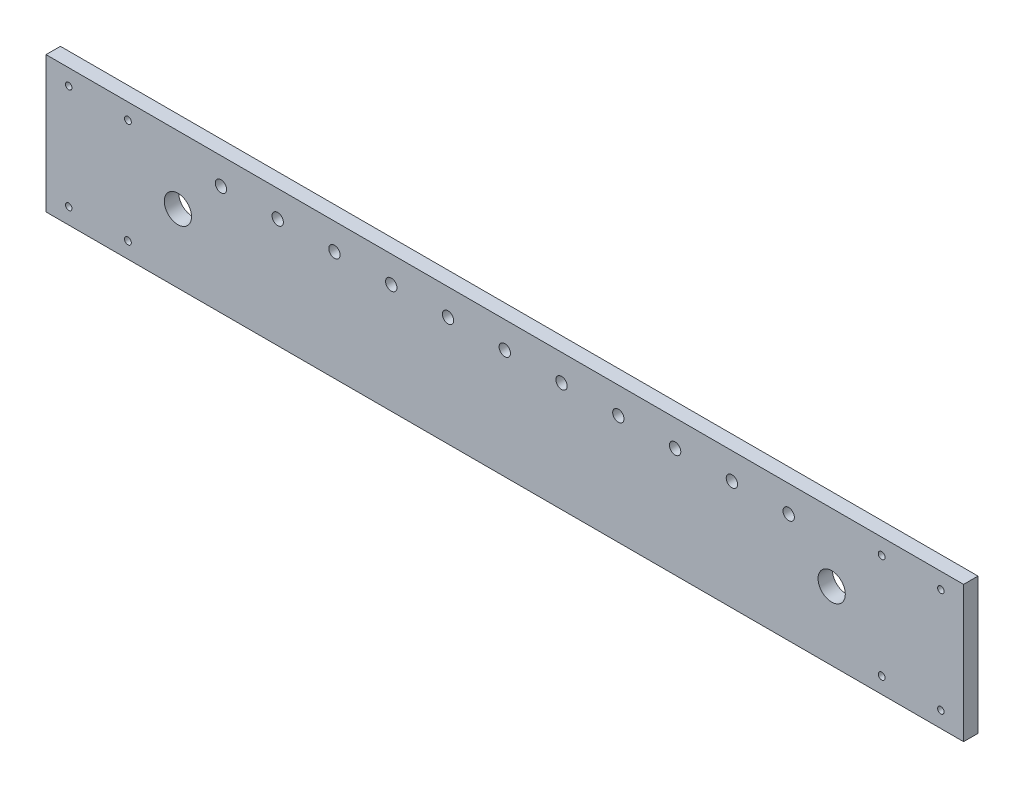
ISO-10303-21;
HEADER;
FILE_DESCRIPTION(('STEP AP214'),'2;1');
FILE_NAME('part.step','',(''),(''),'','','');
FILE_SCHEMA(('AUTOMOTIVE_DESIGN { 1 0 10303 214 1 1 1 1 }'));
ENDSEC;
DATA;
#1=APPLICATION_CONTEXT('core data for automotive mechanical design processes');
#2=APPLICATION_PROTOCOL_DEFINITION('international standard','automotive_design',2000,#1);
#3=PRODUCT_CONTEXT('',#1,'mechanical');
#4=PRODUCT('Part','Part','',(#3));
#5=PRODUCT_RELATED_PRODUCT_CATEGORY('part','',(#4));
#6=PRODUCT_DEFINITION_FORMATION('','',#4);
#7=PRODUCT_DEFINITION_CONTEXT('part definition',#1,'design');
#8=PRODUCT_DEFINITION('design','',#6,#7);
#9=PRODUCT_DEFINITION_SHAPE('','',#8);
#10=(LENGTH_UNIT() NAMED_UNIT(*) SI_UNIT(.MILLI.,.METRE.));
#11=(NAMED_UNIT(*) PLANE_ANGLE_UNIT() SI_UNIT($,.RADIAN.));
#12=(NAMED_UNIT(*) SI_UNIT($,.STERADIAN.) SOLID_ANGLE_UNIT());
#13=UNCERTAINTY_MEASURE_WITH_UNIT(LENGTH_MEASURE(1.E-05),#10,'distance_accuracy_value','');
#14=(GEOMETRIC_REPRESENTATION_CONTEXT(3) GLOBAL_UNCERTAINTY_ASSIGNED_CONTEXT((#13)) GLOBAL_UNIT_ASSIGNED_CONTEXT((#10,
#11,#12)) REPRESENTATION_CONTEXT('',''));
#15=CARTESIAN_POINT('',(0.,0.,0.));
#16=DIRECTION('',(0.,0.,1.));
#17=DIRECTION('',(1.,0.,0.));
#18=AXIS2_PLACEMENT_3D('',#15,#16,#17);
#19=CARTESIAN_POINT('',(0.,30.,-6.35));
#20=DIRECTION('',(0.,1.,0.));
#21=DIRECTION('',(-1.,0.,0.));
#22=AXIS2_PLACEMENT_3D('',#19,#20,#21);
#23=PLANE('',#22);
#24=DIRECTION('',(-1.,0.,0.));
#25=VECTOR('',#24,1.);
#26=CARTESIAN_POINT('',(0.,30.,0.));
#27=LINE('',#26,#25);
#28=CARTESIAN_POINT('',(199.519643121393,30.,0.));
#29=VERTEX_POINT('',#28);
#30=CARTESIAN_POINT('',(-204.530552078607,30.,0.));
#31=VERTEX_POINT('',#30);
#32=EDGE_CURVE('E102',#29,#31,#27,.T.);
#33=ORIENTED_EDGE('',*,*,#32,.F.);
#34=DIRECTION('',(0.,0.,1.));
#35=VECTOR('',#34,1.);
#36=CARTESIAN_POINT('',(199.519643121393,30.,-6.35));
#37=LINE('',#36,#35);
#38=CARTESIAN_POINT('',(199.519643121393,30.,-6.35));
#39=VERTEX_POINT('',#38);
#40=EDGE_CURVE('E11',#39,#29,#37,.T.);
#41=ORIENTED_EDGE('',*,*,#40,.F.);
#42=DIRECTION('',(-1.,0.,0.));
#43=VECTOR('',#42,1.);
#44=CARTESIAN_POINT('',(0.,30.,-6.35));
#45=LINE('',#44,#43);
#46=CARTESIAN_POINT('',(-204.530552078607,30.,-6.35));
#47=VERTEX_POINT('',#46);
#48=EDGE_CURVE('E95',#39,#47,#45,.T.);
#49=ORIENTED_EDGE('',*,*,#48,.T.);
#50=DIRECTION('',(0.,0.,1.));
#51=VECTOR('',#50,1.);
#52=CARTESIAN_POINT('',(-204.530552078607,30.,-6.35));
#53=LINE('',#52,#51);
#54=EDGE_CURVE('E78',#47,#31,#53,.T.);
#55=ORIENTED_EDGE('',*,*,#54,.T.);
#56=EDGE_LOOP('',(#33,#41,#49,#55));
#57=FACE_BOUND('',#56,.T.);
#58=ADVANCED_FACE('F35',(#57),#23,.T.);
#59=CARTESIAN_POINT('',(199.519643121393,0.,-6.35));
#60=DIRECTION('',(1.,0.,0.));
#61=DIRECTION('',(0.,0.,-1.));
#62=AXIS2_PLACEMENT_3D('',#59,#60,#61);
#63=PLANE('',#62);
#64=DIRECTION('',(0.,1.,0.));
#65=VECTOR('',#64,1.);
#66=CARTESIAN_POINT('',(199.519643121393,0.,0.));
#67=LINE('',#66,#65);
#68=CARTESIAN_POINT('',(199.519643121393,-30.,0.));
#69=VERTEX_POINT('',#68);
#70=EDGE_CURVE('E97',#69,#29,#67,.T.);
#71=ORIENTED_EDGE('',*,*,#70,.F.);
#72=DIRECTION('',(0.,0.,1.));
#73=VECTOR('',#72,1.);
#74=CARTESIAN_POINT('',(199.519643121393,-30.,-6.35));
#75=LINE('',#74,#73);
#76=CARTESIAN_POINT('',(199.519643121393,-30.,-6.35));
#77=VERTEX_POINT('',#76);
#78=EDGE_CURVE('E44',#77,#69,#75,.T.);
#79=ORIENTED_EDGE('',*,*,#78,.F.);
#80=DIRECTION('',(0.,1.,0.));
#81=VECTOR('',#80,1.);
#82=CARTESIAN_POINT('',(199.519643121393,0.,-6.35));
#83=LINE('',#82,#81);
#84=EDGE_CURVE('E92',#77,#39,#83,.T.);
#85=ORIENTED_EDGE('',*,*,#84,.T.);
#86=ORIENTED_EDGE('',*,*,#40,.T.);
#87=EDGE_LOOP('',(#71,#79,#85,#86));
#88=FACE_BOUND('',#87,.T.);
#89=ADVANCED_FACE('F246',(#88),#63,.T.);
#90=CARTESIAN_POINT('',(0.,-30.,-6.35));
#91=DIRECTION('',(0.,-1.,0.));
#92=DIRECTION('',(1.,0.,0.));
#93=AXIS2_PLACEMENT_3D('',#90,#91,#92);
#94=PLANE('',#93);
#95=DIRECTION('',(1.,0.,0.));
#96=VECTOR('',#95,1.);
#97=CARTESIAN_POINT('',(0.,-30.,0.));
#98=LINE('',#97,#96);
#99=CARTESIAN_POINT('',(-204.530552078607,-30.,0.));
#100=VERTEX_POINT('',#99);
#101=EDGE_CURVE('E86',#100,#69,#98,.T.);
#102=ORIENTED_EDGE('',*,*,#101,.F.);
#103=DIRECTION('',(0.,0.,1.));
#104=VECTOR('',#103,1.);
#105=CARTESIAN_POINT('',(-204.530552078607,-30.,-6.35));
#106=LINE('',#105,#104);
#107=CARTESIAN_POINT('',(-204.530552078607,-30.,-6.35));
#108=VERTEX_POINT('',#107);
#109=EDGE_CURVE('E81',#108,#100,#106,.T.);
#110=ORIENTED_EDGE('',*,*,#109,.F.);
#111=DIRECTION('',(1.,0.,0.));
#112=VECTOR('',#111,1.);
#113=CARTESIAN_POINT('',(0.,-30.,-6.35));
#114=LINE('',#113,#112);
#115=EDGE_CURVE('E84',#108,#77,#114,.T.);
#116=ORIENTED_EDGE('',*,*,#115,.T.);
#117=ORIENTED_EDGE('',*,*,#78,.T.);
#118=EDGE_LOOP('',(#102,#110,#116,#117));
#119=FACE_BOUND('',#118,.T.);
#120=ADVANCED_FACE('F83',(#119),#94,.T.);
#121=CARTESIAN_POINT('',(-204.530552078607,0.,-6.35));
#122=DIRECTION('',(-1.,0.,0.));
#123=DIRECTION('',(0.,0.,1.));
#124=AXIS2_PLACEMENT_3D('',#121,#122,#123);
#125=PLANE('',#124);
#126=DIRECTION('',(0.,-1.,0.));
#127=VECTOR('',#126,1.);
#128=CARTESIAN_POINT('',(-204.530552078607,0.,0.));
#129=LINE('',#128,#127);
#130=EDGE_CURVE('E105',#31,#100,#129,.T.);
#131=ORIENTED_EDGE('',*,*,#130,.F.);
#132=ORIENTED_EDGE('',*,*,#54,.F.);
#133=DIRECTION('',(0.,-1.,0.));
#134=VECTOR('',#133,1.);
#135=CARTESIAN_POINT('',(-204.530552078607,0.,-6.35));
#136=LINE('',#135,#134);
#137=EDGE_CURVE('E91',#47,#108,#136,.T.);
#138=ORIENTED_EDGE('',*,*,#137,.T.);
#139=ORIENTED_EDGE('',*,*,#109,.T.);
#140=EDGE_LOOP('',(#131,#132,#138,#139));
#141=FACE_BOUND('',#140,.T.);
#142=ADVANCED_FACE('F94',(#141),#125,.T.);
#143=CARTESIAN_POINT('',(0.,0.,-6.35));
#144=DIRECTION('',(0.,0.,1.));
#145=DIRECTION('',(1.,0.,0.));
#146=AXIS2_PLACEMENT_3D('',#143,#144,#145);
#147=PLANE('',#146);
#148=CARTESIAN_POINT('',(141.435795620172,0.190500000000144,-6.35));
#149=DIRECTION('',(0.,0.,-1.));
#150=DIRECTION('',(-1.,0.,0.));
#151=AXIS2_PLACEMENT_3D('',#148,#149,#150);
#152=CIRCLE('',#151,6.00000000000505);
#153=CARTESIAN_POINT('',(135.435795620167,0.190500000000144,-6.35));
#154=VERTEX_POINT('',#153);
#155=EDGE_CURVE('E128',#154,#154,#152,.T.);
#156=ORIENTED_EDGE('',*,*,#155,.F.);
#157=EDGE_LOOP('',(#156));
#158=FACE_BOUND('',#157,.T.);
#159=CARTESIAN_POINT('',(-146.446704577386,0.190500000000546,-6.35));
#160=DIRECTION('',(0.,0.,-1.));
#161=DIRECTION('',(1.,0.,0.));
#162=AXIS2_PLACEMENT_3D('',#159,#160,#161);
#163=CIRCLE('',#162,6.00000000000504);
#164=CARTESIAN_POINT('',(-140.446704577381,0.190500000000546,-6.35));
#165=VERTEX_POINT('',#164);
#166=EDGE_CURVE('E134',#165,#165,#163,.T.);
#167=ORIENTED_EDGE('',*,*,#166,.F.);
#168=EDGE_LOOP('',(#167));
#169=FACE_BOUND('',#168,.T.);
#170=CARTESIAN_POINT('',(189.519643121393,22.9999999999999,-6.35));
#171=DIRECTION('',(0.,0.,1.));
#172=DIRECTION('',(-1.,0.,0.));
#173=AXIS2_PLACEMENT_3D('',#170,#171,#172);
#174=CIRCLE('',#173,1.42499999999996);
#175=CARTESIAN_POINT('',(188.094643121393,22.9999999999999,-6.35));
#176=VERTEX_POINT('',#175);
#177=EDGE_CURVE('E154',#176,#176,#174,.T.);
#178=ORIENTED_EDGE('',*,*,#177,.T.);
#179=EDGE_LOOP('',(#178));
#180=FACE_BOUND('',#179,.T.);
#181=CARTESIAN_POINT('',(189.519643121393,-22.9999999999999,-6.35));
#182=DIRECTION('',(0.,0.,1.));
#183=DIRECTION('',(1.,0.,0.));
#184=AXIS2_PLACEMENT_3D('',#181,#182,#183);
#185=CIRCLE('',#184,1.42500000000002);
#186=CARTESIAN_POINT('',(190.944643121393,-22.9999999999999,-6.35));
#187=VERTEX_POINT('',#186);
#188=EDGE_CURVE('E148',#187,#187,#185,.T.);
#189=ORIENTED_EDGE('',*,*,#188,.T.);
#190=EDGE_LOOP('',(#189));
#191=FACE_BOUND('',#190,.T.);
#192=CARTESIAN_POINT('',(-194.530552078607,-23.,-6.35));
#193=DIRECTION('',(0.,0.,1.));
#194=DIRECTION('',(-1.,0.,0.));
#195=AXIS2_PLACEMENT_3D('',#192,#193,#194);
#196=CIRCLE('',#195,1.42500000000002);
#197=CARTESIAN_POINT('',(-195.955552078607,-23.,-6.35));
#198=VERTEX_POINT('',#197);
#199=EDGE_CURVE('E141',#198,#198,#196,.T.);
#200=ORIENTED_EDGE('',*,*,#199,.T.);
#201=EDGE_LOOP('',(#200));
#202=FACE_BOUND('',#201,.T.);
#203=CARTESIAN_POINT('',(-194.530552078607,23.,-6.35));
#204=DIRECTION('',(0.,0.,1.));
#205=DIRECTION('',(1.,0.,0.));
#206=AXIS2_PLACEMENT_3D('',#203,#204,#205);
#207=CIRCLE('',#206,1.42500000000002);
#208=CARTESIAN_POINT('',(-193.105552078607,23.,-6.35));
#209=VERTEX_POINT('',#208);
#210=EDGE_CURVE('E159',#209,#209,#207,.T.);
#211=ORIENTED_EDGE('',*,*,#210,.T.);
#212=EDGE_LOOP('',(#211));
#213=FACE_BOUND('',#212,.T.);
#214=CARTESIAN_POINT('',(163.444948118961,22.9999999999999,-6.35));
#215=DIRECTION('',(0.,0.,-1.));
#216=DIRECTION('',(-1.,0.,0.));
#217=AXIS2_PLACEMENT_3D('',#214,#215,#216);
#218=CIRCLE('',#217,1.50000000000014);
#219=CARTESIAN_POINT('',(161.944948118961,22.9999999999999,-6.35));
#220=VERTEX_POINT('',#219);
#221=EDGE_CURVE('E162',#220,#220,#218,.T.);
#222=ORIENTED_EDGE('',*,*,#221,.F.);
#223=EDGE_LOOP('',(#222));
#224=FACE_BOUND('',#223,.T.);
#225=CARTESIAN_POINT('',(163.444948118961,-23.,-6.35));
#226=DIRECTION('',(0.,0.,-1.));
#227=DIRECTION('',(-1.,0.,0.));
#228=AXIS2_PLACEMENT_3D('',#225,#226,#227);
#229=CIRCLE('',#228,1.5);
#230=CARTESIAN_POINT('',(161.944948118961,-23.,-6.35));
#231=VERTEX_POINT('',#230);
#232=EDGE_CURVE('E168',#231,#231,#229,.T.);
#233=ORIENTED_EDGE('',*,*,#232,.F.);
#234=EDGE_LOOP('',(#233));
#235=FACE_BOUND('',#234,.T.);
#236=CARTESIAN_POINT('',(-168.455857076175,-23.,-6.35));
#237=DIRECTION('',(0.,0.,-1.));
#238=DIRECTION('',(-1.,0.,0.));
#239=AXIS2_PLACEMENT_3D('',#236,#237,#238);
#240=CIRCLE('',#239,1.5);
#241=CARTESIAN_POINT('',(-169.955857076175,-23.,-6.35));
#242=VERTEX_POINT('',#241);
#243=EDGE_CURVE('E165',#242,#242,#240,.T.);
#244=ORIENTED_EDGE('',*,*,#243,.F.);
#245=EDGE_LOOP('',(#244));
#246=FACE_BOUND('',#245,.T.);
#247=CARTESIAN_POINT('',(-168.455857076175,22.9999999999999,-6.35));
#248=DIRECTION('',(0.,0.,-1.));
#249=DIRECTION('',(-1.,0.,0.));
#250=AXIS2_PLACEMENT_3D('',#247,#248,#249);
#251=CIRCLE('',#250,1.50000000000014);
#252=CARTESIAN_POINT('',(-169.955857076175,22.9999999999999,-6.35));
#253=VERTEX_POINT('',#252);
#254=EDGE_CURVE('E117',#253,#253,#251,.T.);
#255=ORIENTED_EDGE('',*,*,#254,.F.);
#256=EDGE_LOOP('',(#255));
#257=FACE_BOUND('',#256,.T.);
#258=CARTESIAN_POINT('',(-127.505454478587,18.3224130468526,-6.35));
#259=DIRECTION('',(0.,0.,1.));
#260=DIRECTION('',(1.,0.,0.));
#261=AXIS2_PLACEMENT_3D('',#258,#259,#260);
#262=CIRCLE('',#261,2.5);
#263=CARTESIAN_POINT('',(-125.005454478587,18.3224130468526,-6.35));
#264=VERTEX_POINT('',#263);
#265=EDGE_CURVE('E125',#264,#264,#262,.T.);
#266=ORIENTED_EDGE('',*,*,#265,.T.);
#267=EDGE_LOOP('',(#266));
#268=FACE_BOUND('',#267,.T.);
#269=CARTESIAN_POINT('',(-102.505454478587,18.3224130468523,-6.35));
#270=DIRECTION('',(0.,0.,1.));
#271=DIRECTION('',(1.,0.,0.));
#272=AXIS2_PLACEMENT_3D('',#269,#270,#271);
#273=CIRCLE('',#272,2.5);
#274=CARTESIAN_POINT('',(-100.005454478587,18.3224130468523,-6.35));
#275=VERTEX_POINT('',#274);
#276=EDGE_CURVE('E227',#275,#275,#273,.T.);
#277=ORIENTED_EDGE('',*,*,#276,.T.);
#278=EDGE_LOOP('',(#277));
#279=FACE_BOUND('',#278,.T.);
#280=CARTESIAN_POINT('',(47.4945455214126,18.3224130468507,-6.35));
#281=DIRECTION('',(0.,0.,1.));
#282=DIRECTION('',(1.,0.,0.));
#283=AXIS2_PLACEMENT_3D('',#280,#281,#282);
#284=CIRCLE('',#283,2.5);
#285=CARTESIAN_POINT('',(49.9945455214126,18.3224130468507,-6.35));
#286=VERTEX_POINT('',#285);
#287=EDGE_CURVE('E178',#286,#286,#284,.T.);
#288=ORIENTED_EDGE('',*,*,#287,.T.);
#289=EDGE_LOOP('',(#288));
#290=FACE_BOUND('',#289,.T.);
#291=CARTESIAN_POINT('',(72.4945455214125,18.3224130468505,-6.35));
#292=DIRECTION('',(0.,0.,1.));
#293=DIRECTION('',(1.,0.,0.));
#294=AXIS2_PLACEMENT_3D('',#291,#292,#293);
#295=CIRCLE('',#294,2.5);
#296=CARTESIAN_POINT('',(74.9945455214125,18.3224130468505,-6.35));
#297=VERTEX_POINT('',#296);
#298=EDGE_CURVE('E205',#297,#297,#295,.T.);
#299=ORIENTED_EDGE('',*,*,#298,.T.);
#300=EDGE_LOOP('',(#299));
#301=FACE_BOUND('',#300,.T.);
#302=CARTESIAN_POINT('',(122.494545521413,18.3224130468499,-6.35));
#303=DIRECTION('',(0.,0.,1.));
#304=DIRECTION('',(1.,0.,0.));
#305=AXIS2_PLACEMENT_3D('',#302,#303,#304);
#306=CIRCLE('',#305,2.5);
#307=CARTESIAN_POINT('',(124.994545521413,18.3224130468499,-6.35));
#308=VERTEX_POINT('',#307);
#309=EDGE_CURVE('E204',#308,#308,#306,.T.);
#310=ORIENTED_EDGE('',*,*,#309,.T.);
#311=EDGE_LOOP('',(#310));
#312=FACE_BOUND('',#311,.T.);
#313=CARTESIAN_POINT('',(-77.5054544785875,18.322413046852,-6.35));
#314=DIRECTION('',(0.,0.,1.));
#315=DIRECTION('',(1.,0.,0.));
#316=AXIS2_PLACEMENT_3D('',#313,#314,#315);
#317=CIRCLE('',#316,2.5);
#318=CARTESIAN_POINT('',(-75.0054544785875,18.322413046852,-6.35));
#319=VERTEX_POINT('',#318);
#320=EDGE_CURVE('E217',#319,#319,#317,.T.);
#321=ORIENTED_EDGE('',*,*,#320,.T.);
#322=EDGE_LOOP('',(#321));
#323=FACE_BOUND('',#322,.T.);
#324=CARTESIAN_POINT('',(22.4945455214125,18.3224130468511,-6.35));
#325=DIRECTION('',(0.,0.,1.));
#326=DIRECTION('',(1.,0.,0.));
#327=AXIS2_PLACEMENT_3D('',#324,#325,#326);
#328=CIRCLE('',#327,2.5);
#329=CARTESIAN_POINT('',(24.9945455214125,18.3224130468511,-6.35));
#330=VERTEX_POINT('',#329);
#331=EDGE_CURVE('E179',#330,#330,#328,.T.);
#332=ORIENTED_EDGE('',*,*,#331,.T.);
#333=EDGE_LOOP('',(#332));
#334=FACE_BOUND('',#333,.T.);
#335=CARTESIAN_POINT('',(-2.50545447858738,18.3224130468513,-6.35));
#336=DIRECTION('',(0.,0.,1.));
#337=DIRECTION('',(1.,0.,0.));
#338=AXIS2_PLACEMENT_3D('',#335,#336,#337);
#339=CIRCLE('',#338,2.5);
#340=CARTESIAN_POINT('',(-0.00545447858737958,18.3224130468513,-6.35));
#341=VERTEX_POINT('',#340);
#342=EDGE_CURVE('E185',#341,#341,#339,.T.);
#343=ORIENTED_EDGE('',*,*,#342,.T.);
#344=EDGE_LOOP('',(#343));
#345=FACE_BOUND('',#344,.T.);
#346=CARTESIAN_POINT('',(-27.5054544785875,18.3224130468515,-6.35));
#347=DIRECTION('',(0.,0.,1.));
#348=DIRECTION('',(1.,0.,0.));
#349=AXIS2_PLACEMENT_3D('',#346,#347,#348);
#350=CIRCLE('',#349,2.5);
#351=CARTESIAN_POINT('',(-25.0054544785875,18.3224130468515,-6.35));
#352=VERTEX_POINT('',#351);
#353=EDGE_CURVE('E191',#352,#352,#350,.T.);
#354=ORIENTED_EDGE('',*,*,#353,.T.);
#355=EDGE_LOOP('',(#354));
#356=FACE_BOUND('',#355,.T.);
#357=CARTESIAN_POINT('',(-52.5054544785874,18.3224130468518,-6.35));
#358=DIRECTION('',(0.,0.,1.));
#359=DIRECTION('',(1.,0.,0.));
#360=AXIS2_PLACEMENT_3D('',#357,#358,#359);
#361=CIRCLE('',#360,2.5);
#362=CARTESIAN_POINT('',(-50.0054544785874,18.3224130468518,-6.35));
#363=VERTEX_POINT('',#362);
#364=EDGE_CURVE('E197',#363,#363,#361,.T.);
#365=ORIENTED_EDGE('',*,*,#364,.T.);
#366=EDGE_LOOP('',(#365));
#367=FACE_BOUND('',#366,.T.);
#368=CARTESIAN_POINT('',(97.4945455214125,18.3224130468503,-6.35));
#369=DIRECTION('',(0.,0.,1.));
#370=DIRECTION('',(1.,0.,0.));
#371=AXIS2_PLACEMENT_3D('',#368,#369,#370);
#372=CIRCLE('',#371,2.5);
#373=CARTESIAN_POINT('',(99.9945455214125,18.3224130468503,-6.35));
#374=VERTEX_POINT('',#373);
#375=EDGE_CURVE('E106',#374,#374,#372,.T.);
#376=ORIENTED_EDGE('',*,*,#375,.T.);
#377=EDGE_LOOP('',(#376));
#378=FACE_BOUND('',#377,.T.);
#379=ORIENTED_EDGE('',*,*,#48,.F.);
#380=ORIENTED_EDGE('',*,*,#84,.F.);
#381=ORIENTED_EDGE('',*,*,#115,.F.);
#382=ORIENTED_EDGE('',*,*,#137,.F.);
#383=EDGE_LOOP('',(#379,#380,#381,#382));
#384=FACE_BOUND('',#383,.T.);
#385=ADVANCED_FACE('F90',(#158,#169,#180,#191,#202,#213,#224,#235,#246,#257,#268,#279,#290,#301,
#312,#323,#334,#345,#356,#367,#378,#384),#147,.F.);
#386=CARTESIAN_POINT('',(0.,0.,0.));
#387=DIRECTION('',(0.,0.,1.));
#388=DIRECTION('',(1.,0.,0.));
#389=AXIS2_PLACEMENT_3D('',#386,#387,#388);
#390=PLANE('',#389);
#391=CARTESIAN_POINT('',(141.435795620172,0.190500000000144,0.));
#392=DIRECTION('',(0.,0.,1.));
#393=DIRECTION('',(1.,0.,0.));
#394=AXIS2_PLACEMENT_3D('',#391,#392,#393);
#395=CIRCLE('',#394,6.00000000000505);
#396=CARTESIAN_POINT('',(147.435795620177,0.190500000000144,0.));
#397=VERTEX_POINT('',#396);
#398=EDGE_CURVE('E38',#397,#397,#395,.T.);
#399=ORIENTED_EDGE('',*,*,#398,.F.);
#400=EDGE_LOOP('',(#399));
#401=FACE_BOUND('',#400,.T.);
#402=CARTESIAN_POINT('',(-146.446704577386,0.190500000000546,0.));
#403=DIRECTION('',(0.,0.,1.));
#404=DIRECTION('',(1.,0.,0.));
#405=AXIS2_PLACEMENT_3D('',#402,#403,#404);
#406=CIRCLE('',#405,6.00000000000504);
#407=CARTESIAN_POINT('',(-140.446704577381,0.190500000000546,0.));
#408=VERTEX_POINT('',#407);
#409=EDGE_CURVE('E126',#408,#408,#406,.T.);
#410=ORIENTED_EDGE('',*,*,#409,.F.);
#411=EDGE_LOOP('',(#410));
#412=FACE_BOUND('',#411,.T.);
#413=CARTESIAN_POINT('',(189.519643121393,22.9999999999999,0.));
#414=DIRECTION('',(0.,0.,1.));
#415=DIRECTION('',(-1.,0.,0.));
#416=AXIS2_PLACEMENT_3D('',#413,#414,#415);
#417=CIRCLE('',#416,1.42499999999996);
#418=CARTESIAN_POINT('',(188.094643121393,22.9999999999999,0.));
#419=VERTEX_POINT('',#418);
#420=EDGE_CURVE('E132',#419,#419,#417,.T.);
#421=ORIENTED_EDGE('',*,*,#420,.F.);
#422=EDGE_LOOP('',(#421));
#423=FACE_BOUND('',#422,.T.);
#424=CARTESIAN_POINT('',(189.519643121393,-22.9999999999999,0.));
#425=DIRECTION('',(0.,0.,1.));
#426=DIRECTION('',(1.,0.,0.));
#427=AXIS2_PLACEMENT_3D('',#424,#425,#426);
#428=CIRCLE('',#427,1.42500000000002);
#429=CARTESIAN_POINT('',(190.944643121393,-22.9999999999999,0.));
#430=VERTEX_POINT('',#429);
#431=EDGE_CURVE('E151',#430,#430,#428,.T.);
#432=ORIENTED_EDGE('',*,*,#431,.F.);
#433=EDGE_LOOP('',(#432));
#434=FACE_BOUND('',#433,.T.);
#435=CARTESIAN_POINT('',(-194.530552078607,-23.,0.));
#436=DIRECTION('',(0.,0.,1.));
#437=DIRECTION('',(-1.,0.,0.));
#438=AXIS2_PLACEMENT_3D('',#435,#436,#437);
#439=CIRCLE('',#438,1.42500000000002);
#440=CARTESIAN_POINT('',(-195.955552078607,-23.,0.));
#441=VERTEX_POINT('',#440);
#442=EDGE_CURVE('E145',#441,#441,#439,.T.);
#443=ORIENTED_EDGE('',*,*,#442,.F.);
#444=EDGE_LOOP('',(#443));
#445=FACE_BOUND('',#444,.T.);
#446=CARTESIAN_POINT('',(-194.530552078607,23.,0.));
#447=DIRECTION('',(0.,0.,1.));
#448=DIRECTION('',(1.,0.,0.));
#449=AXIS2_PLACEMENT_3D('',#446,#447,#448);
#450=CIRCLE('',#449,1.42500000000002);
#451=CARTESIAN_POINT('',(-193.105552078607,23.,0.));
#452=VERTEX_POINT('',#451);
#453=EDGE_CURVE('E144',#452,#452,#450,.T.);
#454=ORIENTED_EDGE('',*,*,#453,.F.);
#455=EDGE_LOOP('',(#454));
#456=FACE_BOUND('',#455,.T.);
#457=CARTESIAN_POINT('',(163.444948118961,22.9999999999999,0.));
#458=DIRECTION('',(0.,0.,1.));
#459=DIRECTION('',(1.,0.,0.));
#460=AXIS2_PLACEMENT_3D('',#457,#458,#459);
#461=CIRCLE('',#460,1.50000000000014);
#462=CARTESIAN_POINT('',(164.944948118961,22.9999999999999,0.));
#463=VERTEX_POINT('',#462);
#464=EDGE_CURVE('E123',#463,#463,#461,.T.);
#465=ORIENTED_EDGE('',*,*,#464,.F.);
#466=EDGE_LOOP('',(#465));
#467=FACE_BOUND('',#466,.T.);
#468=CARTESIAN_POINT('',(163.444948118961,-23.,0.));
#469=DIRECTION('',(0.,0.,1.));
#470=DIRECTION('',(1.,0.,0.));
#471=AXIS2_PLACEMENT_3D('',#468,#469,#470);
#472=CIRCLE('',#471,1.5);
#473=CARTESIAN_POINT('',(164.944948118961,-23.,0.));
#474=VERTEX_POINT('',#473);
#475=EDGE_CURVE('E120',#474,#474,#472,.T.);
#476=ORIENTED_EDGE('',*,*,#475,.F.);
#477=EDGE_LOOP('',(#476));
#478=FACE_BOUND('',#477,.T.);
#479=CARTESIAN_POINT('',(-168.455857076175,-23.,0.));
#480=DIRECTION('',(0.,0.,1.));
#481=DIRECTION('',(1.,0.,0.));
#482=AXIS2_PLACEMENT_3D('',#479,#480,#481);
#483=CIRCLE('',#482,1.5);
#484=CARTESIAN_POINT('',(-166.955857076175,-23.,0.));
#485=VERTEX_POINT('',#484);
#486=EDGE_CURVE('E116',#485,#485,#483,.T.);
#487=ORIENTED_EDGE('',*,*,#486,.F.);
#488=EDGE_LOOP('',(#487));
#489=FACE_BOUND('',#488,.T.);
#490=CARTESIAN_POINT('',(-168.455857076175,22.9999999999999,0.));
#491=DIRECTION('',(0.,0.,1.));
#492=DIRECTION('',(1.,0.,0.));
#493=AXIS2_PLACEMENT_3D('',#490,#491,#492);
#494=CIRCLE('',#493,1.50000000000014);
#495=CARTESIAN_POINT('',(-166.955857076175,22.9999999999999,0.));
#496=VERTEX_POINT('',#495);
#497=EDGE_CURVE('E113',#496,#496,#494,.T.);
#498=ORIENTED_EDGE('',*,*,#497,.F.);
#499=EDGE_LOOP('',(#498));
#500=FACE_BOUND('',#499,.T.);
#501=CARTESIAN_POINT('',(-127.505454478587,18.3224130468526,0.));
#502=DIRECTION('',(0.,0.,1.));
#503=DIRECTION('',(1.,0.,0.));
#504=AXIS2_PLACEMENT_3D('',#501,#502,#503);
#505=CIRCLE('',#504,2.5);
#506=CARTESIAN_POINT('',(-125.005454478587,18.3224130468526,0.));
#507=VERTEX_POINT('',#506);
#508=EDGE_CURVE('E230',#507,#507,#505,.T.);
#509=ORIENTED_EDGE('',*,*,#508,.F.);
#510=EDGE_LOOP('',(#509));
#511=FACE_BOUND('',#510,.T.);
#512=CARTESIAN_POINT('',(-102.505454478587,18.3224130468523,0.));
#513=DIRECTION('',(0.,0.,1.));
#514=DIRECTION('',(1.,0.,0.));
#515=AXIS2_PLACEMENT_3D('',#512,#513,#514);
#516=CIRCLE('',#515,2.5);
#517=CARTESIAN_POINT('',(-100.005454478587,18.3224130468523,0.));
#518=VERTEX_POINT('',#517);
#519=EDGE_CURVE('E200',#518,#518,#516,.T.);
#520=ORIENTED_EDGE('',*,*,#519,.F.);
#521=EDGE_LOOP('',(#520));
#522=FACE_BOUND('',#521,.T.);
#523=CARTESIAN_POINT('',(47.4945455214126,18.3224130468507,0.));
#524=DIRECTION('',(0.,0.,1.));
#525=DIRECTION('',(1.,0.,0.));
#526=AXIS2_PLACEMENT_3D('',#523,#524,#525);
#527=CIRCLE('',#526,2.5);
#528=CARTESIAN_POINT('',(49.9945455214126,18.3224130468507,0.));
#529=VERTEX_POINT('',#528);
#530=EDGE_CURVE('E208',#529,#529,#527,.T.);
#531=ORIENTED_EDGE('',*,*,#530,.F.);
#532=EDGE_LOOP('',(#531));
#533=FACE_BOUND('',#532,.T.);
#534=CARTESIAN_POINT('',(72.4945455214125,18.3224130468505,0.));
#535=DIRECTION('',(0.,0.,1.));
#536=DIRECTION('',(1.,0.,0.));
#537=AXIS2_PLACEMENT_3D('',#534,#535,#536);
#538=CIRCLE('',#537,2.5);
#539=CARTESIAN_POINT('',(74.9945455214125,18.3224130468505,0.));
#540=VERTEX_POINT('',#539);
#541=EDGE_CURVE('E201',#540,#540,#538,.T.);
#542=ORIENTED_EDGE('',*,*,#541,.F.);
#543=EDGE_LOOP('',(#542));
#544=FACE_BOUND('',#543,.T.);
#545=CARTESIAN_POINT('',(122.494545521413,18.3224130468499,0.));
#546=DIRECTION('',(0.,0.,1.));
#547=DIRECTION('',(1.,0.,0.));
#548=AXIS2_PLACEMENT_3D('',#545,#546,#547);
#549=CIRCLE('',#548,2.5);
#550=CARTESIAN_POINT('',(124.994545521413,18.3224130468499,0.));
#551=VERTEX_POINT('',#550);
#552=EDGE_CURVE('E220',#551,#551,#549,.T.);
#553=ORIENTED_EDGE('',*,*,#552,.F.);
#554=EDGE_LOOP('',(#553));
#555=FACE_BOUND('',#554,.T.);
#556=CARTESIAN_POINT('',(-77.5054544785875,18.322413046852,0.));
#557=DIRECTION('',(0.,0.,1.));
#558=DIRECTION('',(1.,0.,0.));
#559=AXIS2_PLACEMENT_3D('',#556,#557,#558);
#560=CIRCLE('',#559,2.5);
#561=CARTESIAN_POINT('',(-75.0054544785875,18.322413046852,0.));
#562=VERTEX_POINT('',#561);
#563=EDGE_CURVE('E213',#562,#562,#560,.T.);
#564=ORIENTED_EDGE('',*,*,#563,.F.);
#565=EDGE_LOOP('',(#564));
#566=FACE_BOUND('',#565,.T.);
#567=CARTESIAN_POINT('',(22.4945455214125,18.3224130468511,0.));
#568=DIRECTION('',(0.,0.,1.));
#569=DIRECTION('',(1.,0.,0.));
#570=AXIS2_PLACEMENT_3D('',#567,#568,#569);
#571=CIRCLE('',#570,2.5);
#572=CARTESIAN_POINT('',(24.9945455214125,18.3224130468511,0.));
#573=VERTEX_POINT('',#572);
#574=EDGE_CURVE('E175',#573,#573,#571,.T.);
#575=ORIENTED_EDGE('',*,*,#574,.F.);
#576=EDGE_LOOP('',(#575));
#577=FACE_BOUND('',#576,.T.);
#578=CARTESIAN_POINT('',(-2.50545447858738,18.3224130468513,0.));
#579=DIRECTION('',(0.,0.,1.));
#580=DIRECTION('',(1.,0.,0.));
#581=AXIS2_PLACEMENT_3D('',#578,#579,#580);
#582=CIRCLE('',#581,2.5);
#583=CARTESIAN_POINT('',(-0.00545447858737958,18.3224130468513,0.));
#584=VERTEX_POINT('',#583);
#585=EDGE_CURVE('E182',#584,#584,#582,.T.);
#586=ORIENTED_EDGE('',*,*,#585,.F.);
#587=EDGE_LOOP('',(#586));
#588=FACE_BOUND('',#587,.T.);
#589=CARTESIAN_POINT('',(-27.5054544785875,18.3224130468515,0.));
#590=DIRECTION('',(0.,0.,1.));
#591=DIRECTION('',(1.,0.,0.));
#592=AXIS2_PLACEMENT_3D('',#589,#590,#591);
#593=CIRCLE('',#592,2.5);
#594=CARTESIAN_POINT('',(-25.0054544785875,18.3224130468515,0.));
#595=VERTEX_POINT('',#594);
#596=EDGE_CURVE('E188',#595,#595,#593,.T.);
#597=ORIENTED_EDGE('',*,*,#596,.F.);
#598=EDGE_LOOP('',(#597));
#599=FACE_BOUND('',#598,.T.);
#600=CARTESIAN_POINT('',(-52.5054544785874,18.3224130468518,0.));
#601=DIRECTION('',(0.,0.,1.));
#602=DIRECTION('',(1.,0.,0.));
#603=AXIS2_PLACEMENT_3D('',#600,#601,#602);
#604=CIRCLE('',#603,2.5);
#605=CARTESIAN_POINT('',(-50.0054544785874,18.3224130468518,0.));
#606=VERTEX_POINT('',#605);
#607=EDGE_CURVE('E194',#606,#606,#604,.T.);
#608=ORIENTED_EDGE('',*,*,#607,.F.);
#609=EDGE_LOOP('',(#608));
#610=FACE_BOUND('',#609,.T.);
#611=CARTESIAN_POINT('',(97.4945455214125,18.3224130468503,0.));
#612=DIRECTION('',(0.,0.,1.));
#613=DIRECTION('',(1.,0.,0.));
#614=AXIS2_PLACEMENT_3D('',#611,#612,#613);
#615=CIRCLE('',#614,2.5);
#616=CARTESIAN_POINT('',(99.9945455214125,18.3224130468503,0.));
#617=VERTEX_POINT('',#616);
#618=EDGE_CURVE('E216',#617,#617,#615,.T.);
#619=ORIENTED_EDGE('',*,*,#618,.F.);
#620=EDGE_LOOP('',(#619));
#621=FACE_BOUND('',#620,.T.);
#622=ORIENTED_EDGE('',*,*,#32,.T.);
#623=ORIENTED_EDGE('',*,*,#130,.T.);
#624=ORIENTED_EDGE('',*,*,#101,.T.);
#625=ORIENTED_EDGE('',*,*,#70,.T.);
#626=EDGE_LOOP('',(#622,#623,#624,#625));
#627=FACE_BOUND('',#626,.T.);
#628=ADVANCED_FACE('F241',(#401,#412,#423,#434,#445,#456,#467,#478,#489,#500,#511,#522,#533,
#544,#555,#566,#577,#588,#599,#610,#621,#627),#390,.T.);
#629=CARTESIAN_POINT('',(97.4945455214125,18.3224130468503,-6.35));
#630=DIRECTION('',(0.,0.,1.));
#631=DIRECTION('',(1.,0.,0.));
#632=AXIS2_PLACEMENT_3D('',#629,#630,#631);
#633=CYLINDRICAL_SURFACE('',#632,2.5);
#634=ORIENTED_EDGE('',*,*,#375,.F.);
#635=EDGE_LOOP('',(#634));
#636=FACE_BOUND('',#635,.T.);
#637=ORIENTED_EDGE('',*,*,#618,.T.);
#638=EDGE_LOOP('',(#637));
#639=FACE_BOUND('',#638,.T.);
#640=ADVANCED_FACE('F239',(#636,#639),#633,.F.);
#641=CARTESIAN_POINT('',(-52.5054544785874,18.3224130468518,-6.35));
#642=DIRECTION('',(0.,0.,1.));
#643=DIRECTION('',(1.,0.,0.));
#644=AXIS2_PLACEMENT_3D('',#641,#642,#643);
#645=CYLINDRICAL_SURFACE('',#644,2.5);
#646=ORIENTED_EDGE('',*,*,#364,.F.);
#647=EDGE_LOOP('',(#646));
#648=FACE_BOUND('',#647,.T.);
#649=ORIENTED_EDGE('',*,*,#607,.T.);
#650=EDGE_LOOP('',(#649));
#651=FACE_BOUND('',#650,.T.);
#652=ADVANCED_FACE('F266',(#648,#651),#645,.F.);
#653=CARTESIAN_POINT('',(-27.5054544785875,18.3224130468515,-6.35));
#654=DIRECTION('',(0.,0.,1.));
#655=DIRECTION('',(1.,0.,0.));
#656=AXIS2_PLACEMENT_3D('',#653,#654,#655);
#657=CYLINDRICAL_SURFACE('',#656,2.5);
#658=ORIENTED_EDGE('',*,*,#353,.F.);
#659=EDGE_LOOP('',(#658));
#660=FACE_BOUND('',#659,.T.);
#661=ORIENTED_EDGE('',*,*,#596,.T.);
#662=EDGE_LOOP('',(#661));
#663=FACE_BOUND('',#662,.T.);
#664=ADVANCED_FACE('F296',(#660,#663),#657,.F.);
#665=CARTESIAN_POINT('',(-2.50545447858738,18.3224130468513,-6.35));
#666=DIRECTION('',(0.,0.,1.));
#667=DIRECTION('',(1.,0.,0.));
#668=AXIS2_PLACEMENT_3D('',#665,#666,#667);
#669=CYLINDRICAL_SURFACE('',#668,2.5);
#670=ORIENTED_EDGE('',*,*,#342,.F.);
#671=EDGE_LOOP('',(#670));
#672=FACE_BOUND('',#671,.T.);
#673=ORIENTED_EDGE('',*,*,#585,.T.);
#674=EDGE_LOOP('',(#673));
#675=FACE_BOUND('',#674,.T.);
#676=ADVANCED_FACE('F300',(#672,#675),#669,.F.);
#677=CARTESIAN_POINT('',(22.4945455214125,18.3224130468511,-6.35));
#678=DIRECTION('',(0.,0.,1.));
#679=DIRECTION('',(1.,0.,0.));
#680=AXIS2_PLACEMENT_3D('',#677,#678,#679);
#681=CYLINDRICAL_SURFACE('',#680,2.5);
#682=ORIENTED_EDGE('',*,*,#331,.F.);
#683=EDGE_LOOP('',(#682));
#684=FACE_BOUND('',#683,.T.);
#685=ORIENTED_EDGE('',*,*,#574,.T.);
#686=EDGE_LOOP('',(#685));
#687=FACE_BOUND('',#686,.T.);
#688=ADVANCED_FACE('F286',(#684,#687),#681,.F.);
#689=CARTESIAN_POINT('',(-77.5054544785875,18.322413046852,-6.35));
#690=DIRECTION('',(0.,0.,1.));
#691=DIRECTION('',(1.,0.,0.));
#692=AXIS2_PLACEMENT_3D('',#689,#690,#691);
#693=CYLINDRICAL_SURFACE('',#692,2.5);
#694=ORIENTED_EDGE('',*,*,#320,.F.);
#695=EDGE_LOOP('',(#694));
#696=FACE_BOUND('',#695,.T.);
#697=ORIENTED_EDGE('',*,*,#563,.T.);
#698=EDGE_LOOP('',(#697));
#699=FACE_BOUND('',#698,.T.);
#700=ADVANCED_FACE('F282',(#696,#699),#693,.F.);
#701=CARTESIAN_POINT('',(122.494545521413,18.3224130468499,-6.35));
#702=DIRECTION('',(0.,0.,1.));
#703=DIRECTION('',(1.,0.,0.));
#704=AXIS2_PLACEMENT_3D('',#701,#702,#703);
#705=CYLINDRICAL_SURFACE('',#704,2.5);
#706=ORIENTED_EDGE('',*,*,#309,.F.);
#707=EDGE_LOOP('',(#706));
#708=FACE_BOUND('',#707,.T.);
#709=ORIENTED_EDGE('',*,*,#552,.T.);
#710=EDGE_LOOP('',(#709));
#711=FACE_BOUND('',#710,.T.);
#712=ADVANCED_FACE('F278',(#708,#711),#705,.F.);
#713=CARTESIAN_POINT('',(72.4945455214125,18.3224130468505,-6.35));
#714=DIRECTION('',(0.,0.,1.));
#715=DIRECTION('',(1.,0.,0.));
#716=AXIS2_PLACEMENT_3D('',#713,#714,#715);
#717=CYLINDRICAL_SURFACE('',#716,2.5);
#718=ORIENTED_EDGE('',*,*,#298,.F.);
#719=EDGE_LOOP('',(#718));
#720=FACE_BOUND('',#719,.T.);
#721=ORIENTED_EDGE('',*,*,#541,.T.);
#722=EDGE_LOOP('',(#721));
#723=FACE_BOUND('',#722,.T.);
#724=ADVANCED_FACE('F281',(#720,#723),#717,.F.);
#725=CARTESIAN_POINT('',(47.4945455214126,18.3224130468507,-6.35));
#726=DIRECTION('',(0.,0.,1.));
#727=DIRECTION('',(1.,0.,0.));
#728=AXIS2_PLACEMENT_3D('',#725,#726,#727);
#729=CYLINDRICAL_SURFACE('',#728,2.5);
#730=ORIENTED_EDGE('',*,*,#287,.F.);
#731=EDGE_LOOP('',(#730));
#732=FACE_BOUND('',#731,.T.);
#733=ORIENTED_EDGE('',*,*,#530,.T.);
#734=EDGE_LOOP('',(#733));
#735=FACE_BOUND('',#734,.T.);
#736=ADVANCED_FACE('F276',(#732,#735),#729,.F.);
#737=CARTESIAN_POINT('',(-102.505454478587,18.3224130468523,-6.35));
#738=DIRECTION('',(0.,0.,1.));
#739=DIRECTION('',(1.,0.,0.));
#740=AXIS2_PLACEMENT_3D('',#737,#738,#739);
#741=CYLINDRICAL_SURFACE('',#740,2.5);
#742=ORIENTED_EDGE('',*,*,#276,.F.);
#743=EDGE_LOOP('',(#742));
#744=FACE_BOUND('',#743,.T.);
#745=ORIENTED_EDGE('',*,*,#519,.T.);
#746=EDGE_LOOP('',(#745));
#747=FACE_BOUND('',#746,.T.);
#748=ADVANCED_FACE('F272',(#744,#747),#741,.F.);
#749=CARTESIAN_POINT('',(-127.505454478587,18.3224130468526,-6.35));
#750=DIRECTION('',(0.,0.,1.));
#751=DIRECTION('',(1.,0.,0.));
#752=AXIS2_PLACEMENT_3D('',#749,#750,#751);
#753=CYLINDRICAL_SURFACE('',#752,2.5);
#754=ORIENTED_EDGE('',*,*,#265,.F.);
#755=EDGE_LOOP('',(#754));
#756=FACE_BOUND('',#755,.T.);
#757=ORIENTED_EDGE('',*,*,#508,.T.);
#758=EDGE_LOOP('',(#757));
#759=FACE_BOUND('',#758,.T.);
#760=ADVANCED_FACE('F268',(#756,#759),#753,.F.);
#761=CARTESIAN_POINT('',(-168.455857076175,22.9999999999999,3.65));
#762=DIRECTION('',(0.,0.,-1.));
#763=DIRECTION('',(-1.,0.,0.));
#764=AXIS2_PLACEMENT_3D('',#761,#762,#763);
#765=CYLINDRICAL_SURFACE('',#764,1.50000000000014);
#766=ORIENTED_EDGE('',*,*,#497,.T.);
#767=EDGE_LOOP('',(#766));
#768=FACE_BOUND('',#767,.T.);
#769=ORIENTED_EDGE('',*,*,#254,.T.);
#770=EDGE_LOOP('',(#769));
#771=FACE_BOUND('',#770,.T.);
#772=ADVANCED_FACE('F271',(#768,#771),#765,.F.);
#773=CARTESIAN_POINT('',(-168.455857076175,-23.,3.65));
#774=DIRECTION('',(0.,0.,-1.));
#775=DIRECTION('',(-1.,0.,0.));
#776=AXIS2_PLACEMENT_3D('',#773,#774,#775);
#777=CYLINDRICAL_SURFACE('',#776,1.5);
#778=ORIENTED_EDGE('',*,*,#486,.T.);
#779=EDGE_LOOP('',(#778));
#780=FACE_BOUND('',#779,.T.);
#781=ORIENTED_EDGE('',*,*,#243,.T.);
#782=EDGE_LOOP('',(#781));
#783=FACE_BOUND('',#782,.T.);
#784=ADVANCED_FACE('F310',(#780,#783),#777,.F.);
#785=CARTESIAN_POINT('',(163.444948118961,-23.,3.65));
#786=DIRECTION('',(0.,0.,-1.));
#787=DIRECTION('',(-1.,0.,0.));
#788=AXIS2_PLACEMENT_3D('',#785,#786,#787);
#789=CYLINDRICAL_SURFACE('',#788,1.5);
#790=ORIENTED_EDGE('',*,*,#475,.T.);
#791=EDGE_LOOP('',(#790));
#792=FACE_BOUND('',#791,.T.);
#793=ORIENTED_EDGE('',*,*,#232,.T.);
#794=EDGE_LOOP('',(#793));
#795=FACE_BOUND('',#794,.T.);
#796=ADVANCED_FACE('F316',(#792,#795),#789,.F.);
#797=CARTESIAN_POINT('',(163.444948118961,22.9999999999999,3.65));
#798=DIRECTION('',(0.,0.,-1.));
#799=DIRECTION('',(-1.,0.,0.));
#800=AXIS2_PLACEMENT_3D('',#797,#798,#799);
#801=CYLINDRICAL_SURFACE('',#800,1.50000000000014);
#802=ORIENTED_EDGE('',*,*,#464,.T.);
#803=EDGE_LOOP('',(#802));
#804=FACE_BOUND('',#803,.T.);
#805=ORIENTED_EDGE('',*,*,#221,.T.);
#806=EDGE_LOOP('',(#805));
#807=FACE_BOUND('',#806,.T.);
#808=ADVANCED_FACE('F312',(#804,#807),#801,.F.);
#809=CARTESIAN_POINT('',(-194.530552078607,23.,-6.35));
#810=DIRECTION('',(0.,0.,1.));
#811=DIRECTION('',(1.,0.,0.));
#812=AXIS2_PLACEMENT_3D('',#809,#810,#811);
#813=CYLINDRICAL_SURFACE('',#812,1.42500000000002);
#814=ORIENTED_EDGE('',*,*,#210,.F.);
#815=EDGE_LOOP('',(#814));
#816=FACE_BOUND('',#815,.T.);
#817=ORIENTED_EDGE('',*,*,#453,.T.);
#818=EDGE_LOOP('',(#817));
#819=FACE_BOUND('',#818,.T.);
#820=ADVANCED_FACE('F315',(#816,#819),#813,.F.);
#821=CARTESIAN_POINT('',(-194.530552078607,-23.,-6.35));
#822=DIRECTION('',(0.,0.,1.));
#823=DIRECTION('',(1.,0.,0.));
#824=AXIS2_PLACEMENT_3D('',#821,#822,#823);
#825=CYLINDRICAL_SURFACE('',#824,1.42500000000002);
#826=ORIENTED_EDGE('',*,*,#199,.F.);
#827=EDGE_LOOP('',(#826));
#828=FACE_BOUND('',#827,.T.);
#829=ORIENTED_EDGE('',*,*,#442,.T.);
#830=EDGE_LOOP('',(#829));
#831=FACE_BOUND('',#830,.T.);
#832=ADVANCED_FACE('F326',(#828,#831),#825,.F.);
#833=CARTESIAN_POINT('',(189.519643121393,-22.9999999999999,-6.35));
#834=DIRECTION('',(0.,0.,1.));
#835=DIRECTION('',(1.,0.,0.));
#836=AXIS2_PLACEMENT_3D('',#833,#834,#835);
#837=CYLINDRICAL_SURFACE('',#836,1.42500000000002);
#838=ORIENTED_EDGE('',*,*,#188,.F.);
#839=EDGE_LOOP('',(#838));
#840=FACE_BOUND('',#839,.T.);
#841=ORIENTED_EDGE('',*,*,#431,.T.);
#842=EDGE_LOOP('',(#841));
#843=FACE_BOUND('',#842,.T.);
#844=ADVANCED_FACE('F332',(#840,#843),#837,.F.);
#845=CARTESIAN_POINT('',(189.519643121393,22.9999999999999,-6.35));
#846=DIRECTION('',(0.,0.,1.));
#847=DIRECTION('',(1.,0.,0.));
#848=AXIS2_PLACEMENT_3D('',#845,#846,#847);
#849=CYLINDRICAL_SURFACE('',#848,1.42499999999996);
#850=ORIENTED_EDGE('',*,*,#177,.F.);
#851=EDGE_LOOP('',(#850));
#852=FACE_BOUND('',#851,.T.);
#853=ORIENTED_EDGE('',*,*,#420,.T.);
#854=EDGE_LOOP('',(#853));
#855=FACE_BOUND('',#854,.T.);
#856=ADVANCED_FACE('F328',(#852,#855),#849,.F.);
#857=CARTESIAN_POINT('',(-146.446704577386,0.190500000000546,3.65));
#858=DIRECTION('',(0.,0.,-1.));
#859=DIRECTION('',(-1.,0.,0.));
#860=AXIS2_PLACEMENT_3D('',#857,#858,#859);
#861=CYLINDRICAL_SURFACE('',#860,6.00000000000504);
#862=ORIENTED_EDGE('',*,*,#409,.T.);
#863=EDGE_LOOP('',(#862));
#864=FACE_BOUND('',#863,.T.);
#865=ORIENTED_EDGE('',*,*,#166,.T.);
#866=EDGE_LOOP('',(#865));
#867=FACE_BOUND('',#866,.T.);
#868=ADVANCED_FACE('F331',(#864,#867),#861,.F.);
#869=CARTESIAN_POINT('',(141.435795620172,0.190500000000144,3.65));
#870=DIRECTION('',(0.,0.,-1.));
#871=DIRECTION('',(-1.,0.,0.));
#872=AXIS2_PLACEMENT_3D('',#869,#870,#871);
#873=CYLINDRICAL_SURFACE('',#872,6.00000000000505);
#874=ORIENTED_EDGE('',*,*,#398,.T.);
#875=EDGE_LOOP('',(#874));
#876=FACE_BOUND('',#875,.T.);
#877=ORIENTED_EDGE('',*,*,#155,.T.);
#878=EDGE_LOOP('',(#877));
#879=FACE_BOUND('',#878,.T.);
#880=ADVANCED_FACE('F342',(#876,#879),#873,.F.);
#881=CLOSED_SHELL('',(#58,#89,#120,#142,#385,#628,#640,#652,#664,#676,#688,#700,#712,#724,#736,
#748,#760,#772,#784,#796,#808,#820,#832,#844,#856,#868,#880));
#882=MANIFOLD_SOLID_BREP('B2',#881);
#883=ADVANCED_BREP_SHAPE_REPRESENTATION('',(#18,#882),#14);
#884=SHAPE_DEFINITION_REPRESENTATION(#9,#883);
ENDSEC;
END-ISO-10303-21;
